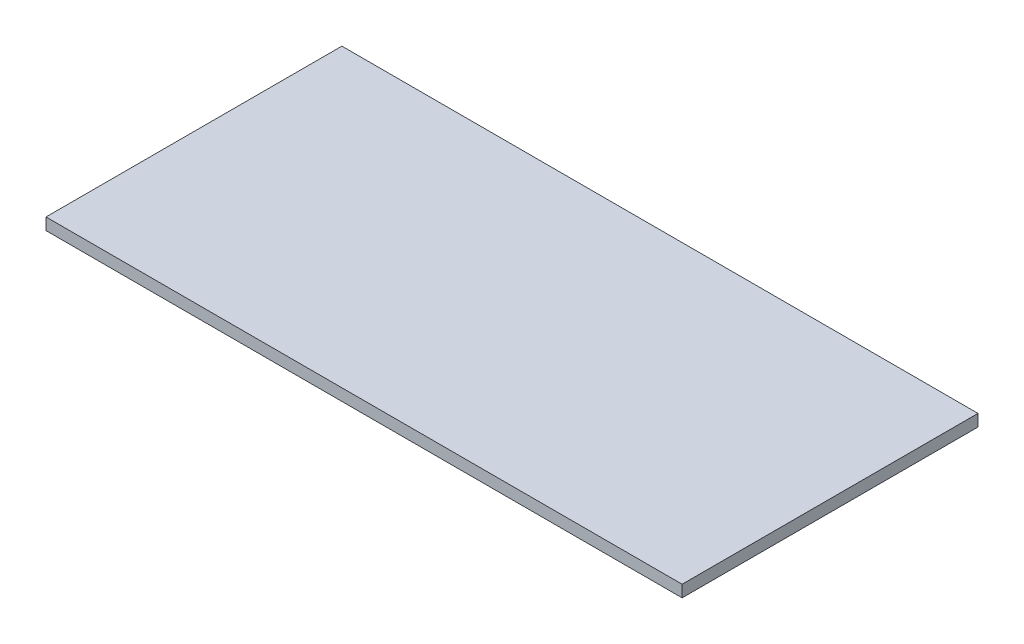
ISO-10303-21;
HEADER;
FILE_DESCRIPTION(('STEP AP214'),'2;1');
FILE_NAME('part.step','',(''),(''),'','','');
FILE_SCHEMA(('AUTOMOTIVE_DESIGN { 1 0 10303 214 1 1 1 1 }'));
ENDSEC;
DATA;
#1=APPLICATION_CONTEXT('core data for automotive mechanical design processes');
#2=APPLICATION_PROTOCOL_DEFINITION('international standard','automotive_design',2000,#1);
#3=PRODUCT_CONTEXT('',#1,'mechanical');
#4=PRODUCT('Part','Part','',(#3));
#5=PRODUCT_RELATED_PRODUCT_CATEGORY('part','',(#4));
#6=PRODUCT_DEFINITION_FORMATION('','',#4);
#7=PRODUCT_DEFINITION_CONTEXT('part definition',#1,'design');
#8=PRODUCT_DEFINITION('design','',#6,#7);
#9=PRODUCT_DEFINITION_SHAPE('','',#8);
#10=(LENGTH_UNIT() NAMED_UNIT(*) SI_UNIT(.MILLI.,.METRE.));
#11=(NAMED_UNIT(*) PLANE_ANGLE_UNIT() SI_UNIT($,.RADIAN.));
#12=(NAMED_UNIT(*) SI_UNIT($,.STERADIAN.) SOLID_ANGLE_UNIT());
#13=UNCERTAINTY_MEASURE_WITH_UNIT(LENGTH_MEASURE(1.E-05),#10,'distance_accuracy_value','');
#14=(GEOMETRIC_REPRESENTATION_CONTEXT(3) GLOBAL_UNCERTAINTY_ASSIGNED_CONTEXT((#13)) GLOBAL_UNIT_ASSIGNED_CONTEXT((#10,
#11,#12)) REPRESENTATION_CONTEXT('',''));
#15=CARTESIAN_POINT('',(0.,0.,0.));
#16=DIRECTION('',(0.,0.,1.));
#17=DIRECTION('',(1.,0.,0.));
#18=AXIS2_PLACEMENT_3D('',#15,#16,#17);
#19=CARTESIAN_POINT('',(0.,8.,0.));
#20=DIRECTION('',(1.,0.,0.));
#21=DIRECTION('',(0.,0.,-1.));
#22=AXIS2_PLACEMENT_3D('',#19,#20,#21);
#23=PLANE('',#22);
#24=DIRECTION('',(0.,0.,1.));
#25=VECTOR('',#24,1.);
#26=CARTESIAN_POINT('',(0.,0.,0.));
#27=LINE('',#26,#25);
#28=CARTESIAN_POINT('',(0.,0.,-200.));
#29=VERTEX_POINT('',#28);
#30=CARTESIAN_POINT('',(0.,0.,0.));
#31=VERTEX_POINT('',#30);
#32=EDGE_CURVE('E94',#29,#31,#27,.T.);
#33=ORIENTED_EDGE('',*,*,#32,.T.);
#34=DIRECTION('',(0.,-1.,0.));
#35=VECTOR('',#34,1.);
#36=CARTESIAN_POINT('',(0.,8.,0.));
#37=LINE('',#36,#35);
#38=CARTESIAN_POINT('',(0.,8.,0.));
#39=VERTEX_POINT('',#38);
#40=EDGE_CURVE('E11',#39,#31,#37,.T.);
#41=ORIENTED_EDGE('',*,*,#40,.F.);
#42=DIRECTION('',(0.,0.,1.));
#43=VECTOR('',#42,1.);
#44=CARTESIAN_POINT('',(0.,8.,0.));
#45=LINE('',#44,#43);
#46=CARTESIAN_POINT('',(0.,8.,-200.));
#47=VERTEX_POINT('',#46);
#48=EDGE_CURVE('E82',#47,#39,#45,.T.);
#49=ORIENTED_EDGE('',*,*,#48,.F.);
#50=DIRECTION('',(0.,-1.,0.));
#51=VECTOR('',#50,1.);
#52=CARTESIAN_POINT('',(0.,8.,-200.));
#53=LINE('',#52,#51);
#54=EDGE_CURVE('E90',#47,#29,#53,.T.);
#55=ORIENTED_EDGE('',*,*,#54,.T.);
#56=EDGE_LOOP('',(#33,#41,#49,#55));
#57=FACE_BOUND('',#56,.T.);
#58=ADVANCED_FACE('F31',(#57),#23,.F.);
#59=CARTESIAN_POINT('',(0.,8.,0.));
#60=DIRECTION('',(0.,0.,-1.));
#61=DIRECTION('',(-1.,0.,0.));
#62=AXIS2_PLACEMENT_3D('',#59,#60,#61);
#63=PLANE('',#62);
#64=DIRECTION('',(1.,0.,0.));
#65=VECTOR('',#64,1.);
#66=CARTESIAN_POINT('',(0.,0.,0.));
#67=LINE('',#66,#65);
#68=CARTESIAN_POINT('',(430.,0.,0.));
#69=VERTEX_POINT('',#68);
#70=EDGE_CURVE('E86',#31,#69,#67,.T.);
#71=ORIENTED_EDGE('',*,*,#70,.T.);
#72=DIRECTION('',(0.,-1.,0.));
#73=VECTOR('',#72,1.);
#74=CARTESIAN_POINT('',(430.,8.,0.));
#75=LINE('',#74,#73);
#76=CARTESIAN_POINT('',(430.,8.,0.));
#77=VERTEX_POINT('',#76);
#78=EDGE_CURVE('E39',#77,#69,#75,.T.);
#79=ORIENTED_EDGE('',*,*,#78,.F.);
#80=DIRECTION('',(1.,0.,0.));
#81=VECTOR('',#80,1.);
#82=CARTESIAN_POINT('',(0.,8.,0.));
#83=LINE('',#82,#81);
#84=EDGE_CURVE('E77',#39,#77,#83,.T.);
#85=ORIENTED_EDGE('',*,*,#84,.F.);
#86=ORIENTED_EDGE('',*,*,#40,.T.);
#87=EDGE_LOOP('',(#71,#79,#85,#86));
#88=FACE_BOUND('',#87,.T.);
#89=ADVANCED_FACE('F85',(#88),#63,.F.);
#90=CARTESIAN_POINT('',(430.,8.,0.));
#91=DIRECTION('',(-1.,0.,0.));
#92=DIRECTION('',(0.,0.,1.));
#93=AXIS2_PLACEMENT_3D('',#90,#91,#92);
#94=PLANE('',#93);
#95=DIRECTION('',(0.,0.,-1.));
#96=VECTOR('',#95,1.);
#97=CARTESIAN_POINT('',(430.,0.,0.));
#98=LINE('',#97,#96);
#99=CARTESIAN_POINT('',(430.,0.,-200.));
#100=VERTEX_POINT('',#99);
#101=EDGE_CURVE('E64',#69,#100,#98,.T.);
#102=ORIENTED_EDGE('',*,*,#101,.T.);
#103=DIRECTION('',(0.,-1.,0.));
#104=VECTOR('',#103,1.);
#105=CARTESIAN_POINT('',(430.,8.,-200.));
#106=LINE('',#105,#104);
#107=CARTESIAN_POINT('',(430.,8.,-200.));
#108=VERTEX_POINT('',#107);
#109=EDGE_CURVE('E87',#108,#100,#106,.T.);
#110=ORIENTED_EDGE('',*,*,#109,.F.);
#111=DIRECTION('',(0.,0.,-1.));
#112=VECTOR('',#111,1.);
#113=CARTESIAN_POINT('',(430.,8.,0.));
#114=LINE('',#113,#112);
#115=EDGE_CURVE('E80',#77,#108,#114,.T.);
#116=ORIENTED_EDGE('',*,*,#115,.F.);
#117=ORIENTED_EDGE('',*,*,#78,.T.);
#118=EDGE_LOOP('',(#102,#110,#116,#117));
#119=FACE_BOUND('',#118,.T.);
#120=ADVANCED_FACE('F88',(#119),#94,.F.);
#121=CARTESIAN_POINT('',(0.,8.,-200.));
#122=DIRECTION('',(0.,0.,1.));
#123=DIRECTION('',(1.,0.,0.));
#124=AXIS2_PLACEMENT_3D('',#121,#122,#123);
#125=PLANE('',#124);
#126=DIRECTION('',(-1.,0.,0.));
#127=VECTOR('',#126,1.);
#128=CARTESIAN_POINT('',(0.,0.,-200.));
#129=LINE('',#128,#127);
#130=EDGE_CURVE('E70',#100,#29,#129,.T.);
#131=ORIENTED_EDGE('',*,*,#130,.T.);
#132=ORIENTED_EDGE('',*,*,#54,.F.);
#133=DIRECTION('',(-1.,0.,0.));
#134=VECTOR('',#133,1.);
#135=CARTESIAN_POINT('',(0.,8.,-200.));
#136=LINE('',#135,#134);
#137=EDGE_CURVE('E47',#108,#47,#136,.T.);
#138=ORIENTED_EDGE('',*,*,#137,.F.);
#139=ORIENTED_EDGE('',*,*,#109,.T.);
#140=EDGE_LOOP('',(#131,#132,#138,#139));
#141=FACE_BOUND('',#140,.T.);
#142=ADVANCED_FACE('F101',(#141),#125,.F.);
#143=CARTESIAN_POINT('',(0.,8.,-200.));
#144=DIRECTION('',(0.,-1.,0.));
#145=DIRECTION('',(0.,0.,-1.));
#146=AXIS2_PLACEMENT_3D('',#143,#144,#145);
#147=PLANE('',#146);
#148=ORIENTED_EDGE('',*,*,#48,.T.);
#149=ORIENTED_EDGE('',*,*,#84,.T.);
#150=ORIENTED_EDGE('',*,*,#115,.T.);
#151=ORIENTED_EDGE('',*,*,#137,.T.);
#152=EDGE_LOOP('',(#148,#149,#150,#151));
#153=FACE_BOUND('',#152,.T.);
#154=ADVANCED_FACE('F78',(#153),#147,.F.);
#155=CARTESIAN_POINT('',(0.,0.,-200.));
#156=DIRECTION('',(0.,-1.,0.));
#157=DIRECTION('',(0.,0.,-1.));
#158=AXIS2_PLACEMENT_3D('',#155,#156,#157);
#159=PLANE('',#158);
#160=ORIENTED_EDGE('',*,*,#32,.F.);
#161=ORIENTED_EDGE('',*,*,#130,.F.);
#162=ORIENTED_EDGE('',*,*,#101,.F.);
#163=ORIENTED_EDGE('',*,*,#70,.F.);
#164=EDGE_LOOP('',(#160,#161,#162,#163));
#165=FACE_BOUND('',#164,.T.);
#166=ADVANCED_FACE('F104',(#165),#159,.T.);
#167=CLOSED_SHELL('',(#58,#89,#120,#142,#154,#166));
#168=MANIFOLD_SOLID_BREP('B2',#167);
#169=ADVANCED_BREP_SHAPE_REPRESENTATION('',(#18,#168),#14);
#170=SHAPE_DEFINITION_REPRESENTATION(#9,#169);
ENDSEC;
END-ISO-10303-21;
